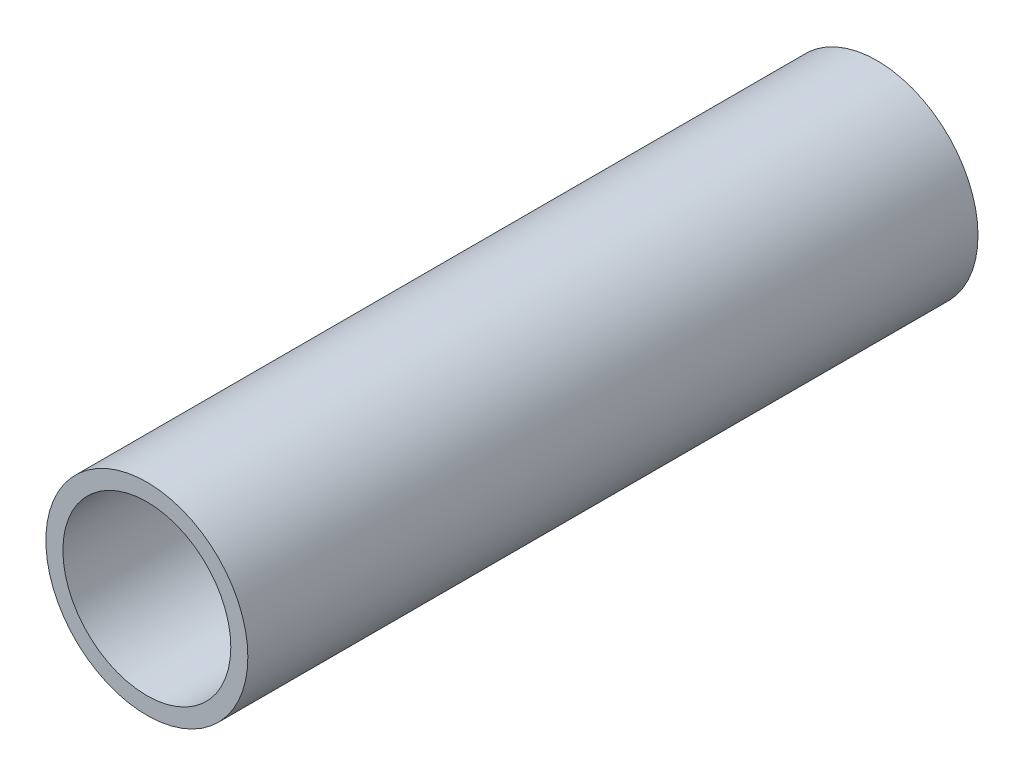
ISO-10303-21;
HEADER;
FILE_DESCRIPTION(('STEP AP214'),'2;1');
FILE_NAME('part.step','',(''),(''),'','','');
FILE_SCHEMA(('AUTOMOTIVE_DESIGN { 1 0 10303 214 1 1 1 1 }'));
ENDSEC;
DATA;
#1=APPLICATION_CONTEXT('core data for automotive mechanical design processes');
#2=APPLICATION_PROTOCOL_DEFINITION('international standard','automotive_design',2000,#1);
#3=PRODUCT_CONTEXT('',#1,'mechanical');
#4=PRODUCT('Part','Part','',(#3));
#5=PRODUCT_RELATED_PRODUCT_CATEGORY('part','',(#4));
#6=PRODUCT_DEFINITION_FORMATION('','',#4);
#7=PRODUCT_DEFINITION_CONTEXT('part definition',#1,'design');
#8=PRODUCT_DEFINITION('design','',#6,#7);
#9=PRODUCT_DEFINITION_SHAPE('','',#8);
#10=(LENGTH_UNIT() NAMED_UNIT(*) SI_UNIT(.MILLI.,.METRE.));
#11=(NAMED_UNIT(*) PLANE_ANGLE_UNIT() SI_UNIT($,.RADIAN.));
#12=(NAMED_UNIT(*) SI_UNIT($,.STERADIAN.) SOLID_ANGLE_UNIT());
#13=UNCERTAINTY_MEASURE_WITH_UNIT(LENGTH_MEASURE(1.E-05),#10,'distance_accuracy_value','');
#14=(GEOMETRIC_REPRESENTATION_CONTEXT(3) GLOBAL_UNCERTAINTY_ASSIGNED_CONTEXT((#13)) GLOBAL_UNIT_ASSIGNED_CONTEXT((#10,
#11,#12)) REPRESENTATION_CONTEXT('',''));
#15=CARTESIAN_POINT('',(0.,0.,0.));
#16=DIRECTION('',(0.,0.,1.));
#17=DIRECTION('',(1.,0.,0.));
#18=AXIS2_PLACEMENT_3D('',#15,#16,#17);
#19=CARTESIAN_POINT('',(0.,0.,152.4));
#20=DIRECTION('',(0.,0.,-1.));
#21=DIRECTION('',(-1.,0.,0.));
#22=AXIS2_PLACEMENT_3D('',#19,#20,#21);
#23=CYLINDRICAL_SURFACE('',#22,17.526);
#24=CARTESIAN_POINT('',(0.,0.,152.4));
#25=DIRECTION('',(0.,0.,1.));
#26=DIRECTION('',(1.,0.,0.));
#27=AXIS2_PLACEMENT_3D('',#24,#25,#26);
#28=CIRCLE('',#27,17.526);
#29=CARTESIAN_POINT('',(17.526,0.,152.4));
#30=VERTEX_POINT('',#29);
#31=EDGE_CURVE('E22',#30,#30,#28,.T.);
#32=ORIENTED_EDGE('',*,*,#31,.T.);
#33=EDGE_LOOP('',(#32));
#34=FACE_BOUND('',#33,.T.);
#35=CARTESIAN_POINT('',(0.,0.,0.));
#36=DIRECTION('',(0.,0.,1.));
#37=DIRECTION('',(1.,0.,0.));
#38=AXIS2_PLACEMENT_3D('',#35,#36,#37);
#39=CIRCLE('',#38,17.526);
#40=CARTESIAN_POINT('',(17.526,0.,0.));
#41=VERTEX_POINT('',#40);
#42=EDGE_CURVE('E33',#41,#41,#39,.T.);
#43=ORIENTED_EDGE('',*,*,#42,.F.);
#44=EDGE_LOOP('',(#43));
#45=FACE_BOUND('',#44,.T.);
#46=ADVANCED_FACE('F14',(#34,#45),#23,.F.);
#47=CARTESIAN_POINT('',(0.,0.,152.4));
#48=DIRECTION('',(0.,0.,-1.));
#49=DIRECTION('',(-1.,0.,0.));
#50=AXIS2_PLACEMENT_3D('',#47,#48,#49);
#51=CYLINDRICAL_SURFACE('',#50,21.082);
#52=CARTESIAN_POINT('',(0.,0.,152.4));
#53=DIRECTION('',(0.,0.,1.));
#54=DIRECTION('',(1.,0.,0.));
#55=AXIS2_PLACEMENT_3D('',#52,#53,#54);
#56=CIRCLE('',#55,21.082);
#57=CARTESIAN_POINT('',(21.082,0.,152.4));
#58=VERTEX_POINT('',#57);
#59=EDGE_CURVE('E10',#58,#58,#56,.T.);
#60=ORIENTED_EDGE('',*,*,#59,.F.);
#61=EDGE_LOOP('',(#60));
#62=FACE_BOUND('',#61,.T.);
#63=CARTESIAN_POINT('',(0.,0.,0.));
#64=DIRECTION('',(0.,0.,1.));
#65=DIRECTION('',(1.,0.,0.));
#66=AXIS2_PLACEMENT_3D('',#63,#64,#65);
#67=CIRCLE('',#66,21.082);
#68=CARTESIAN_POINT('',(21.082,0.,0.));
#69=VERTEX_POINT('',#68);
#70=EDGE_CURVE('E17',#69,#69,#67,.T.);
#71=ORIENTED_EDGE('',*,*,#70,.T.);
#72=EDGE_LOOP('',(#71));
#73=FACE_BOUND('',#72,.T.);
#74=ADVANCED_FACE('F42',(#62,#73),#51,.T.);
#75=CARTESIAN_POINT('',(-50.8,0.,152.4));
#76=DIRECTION('',(0.,0.,1.));
#77=DIRECTION('',(1.,0.,0.));
#78=AXIS2_PLACEMENT_3D('',#75,#76,#77);
#79=PLANE('',#78);
#80=ORIENTED_EDGE('',*,*,#31,.F.);
#81=EDGE_LOOP('',(#80));
#82=FACE_BOUND('',#81,.T.);
#83=ORIENTED_EDGE('',*,*,#59,.T.);
#84=EDGE_LOOP('',(#83));
#85=FACE_BOUND('',#84,.T.);
#86=ADVANCED_FACE('F46',(#82,#85),#79,.T.);
#87=CARTESIAN_POINT('',(-50.8,0.,0.));
#88=DIRECTION('',(0.,0.,1.));
#89=DIRECTION('',(1.,0.,0.));
#90=AXIS2_PLACEMENT_3D('',#87,#88,#89);
#91=PLANE('',#90);
#92=ORIENTED_EDGE('',*,*,#42,.T.);
#93=EDGE_LOOP('',(#92));
#94=FACE_BOUND('',#93,.T.);
#95=ORIENTED_EDGE('',*,*,#70,.F.);
#96=EDGE_LOOP('',(#95));
#97=FACE_BOUND('',#96,.T.);
#98=ADVANCED_FACE('F44',(#94,#97),#91,.F.);
#99=CLOSED_SHELL('',(#46,#74,#86,#98));
#100=MANIFOLD_SOLID_BREP('B1',#99);
#101=ADVANCED_BREP_SHAPE_REPRESENTATION('',(#18,#100),#14);
#102=SHAPE_DEFINITION_REPRESENTATION(#9,#101);
ENDSEC;
END-ISO-10303-21;
